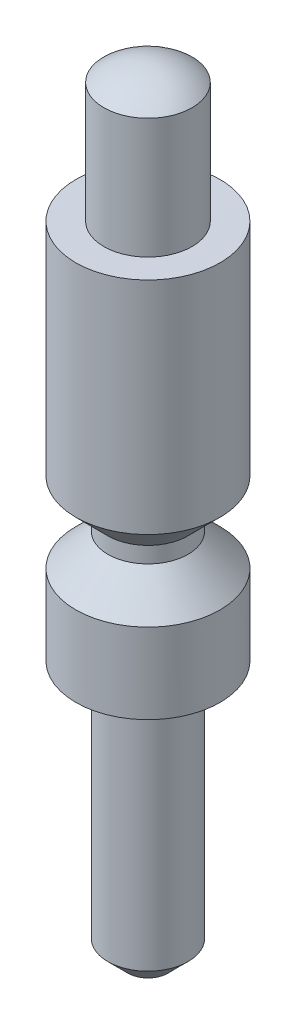
ISO-10303-21;
HEADER;
FILE_DESCRIPTION(('STEP AP214'),'2;1');
FILE_NAME('part.step','',(''),(''),'','','');
FILE_SCHEMA(('AUTOMOTIVE_DESIGN { 1 0 10303 214 1 1 1 1 }'));
ENDSEC;
DATA;
#1=APPLICATION_CONTEXT('core data for automotive mechanical design processes');
#2=APPLICATION_PROTOCOL_DEFINITION('international standard','automotive_design',2000,#1);
#3=PRODUCT_CONTEXT('',#1,'mechanical');
#4=PRODUCT('Part','Part','',(#3));
#5=PRODUCT_RELATED_PRODUCT_CATEGORY('part','',(#4));
#6=PRODUCT_DEFINITION_FORMATION('','',#4);
#7=PRODUCT_DEFINITION_CONTEXT('part definition',#1,'design');
#8=PRODUCT_DEFINITION('design','',#6,#7);
#9=PRODUCT_DEFINITION_SHAPE('','',#8);
#10=(LENGTH_UNIT() NAMED_UNIT(*) SI_UNIT(.MILLI.,.METRE.));
#11=(NAMED_UNIT(*) PLANE_ANGLE_UNIT() SI_UNIT($,.RADIAN.));
#12=(NAMED_UNIT(*) SI_UNIT($,.STERADIAN.) SOLID_ANGLE_UNIT());
#13=UNCERTAINTY_MEASURE_WITH_UNIT(LENGTH_MEASURE(1.E-05),#10,'distance_accuracy_value','');
#14=(GEOMETRIC_REPRESENTATION_CONTEXT(3) GLOBAL_UNCERTAINTY_ASSIGNED_CONTEXT((#13)) GLOBAL_UNIT_ASSIGNED_CONTEXT((#10,
#11,#12)) REPRESENTATION_CONTEXT('',''));
#15=CARTESIAN_POINT('',(0.,0.,0.));
#16=DIRECTION('',(0.,0.,1.));
#17=DIRECTION('',(1.,0.,0.));
#18=AXIS2_PLACEMENT_3D('',#15,#16,#17);
#19=CARTESIAN_POINT('',(-28.92728245926,-5.552019390202,8.065515978186));
#20=DIRECTION('',(0.,-1.,0.));
#21=DIRECTION('',(0.,0.,-1.));
#22=AXIS2_PLACEMENT_3D('',#19,#20,#21);
#23=PLANE('',#22);
#24=CARTESIAN_POINT('',(-29.17728245926,-5.55201939027938,8.065515978186));
#25=DIRECTION('',(0.,1.,0.));
#26=DIRECTION('',(0.,0.,1.));
#27=AXIS2_PLACEMENT_3D('',#24,#25,#26);
#28=CIRCLE('',#27,0.250000000024897);
#29=CARTESIAN_POINT('',(-29.17728245926,-5.55201939027938,8.3155159782109));
#30=VERTEX_POINT('',#29);
#31=EDGE_CURVE('E18',#30,#30,#28,.T.);
#32=ORIENTED_EDGE('',*,*,#31,.F.);
#33=EDGE_LOOP('',(#32));
#34=FACE_BOUND('',#33,.T.);
#35=ADVANCED_FACE('F15',(#34),#23,.T.);
#36=CARTESIAN_POINT('',(-29.17728245926,-5.3020193902853,8.065515978186));
#37=DIRECTION('',(0.,1.,0.));
#38=DIRECTION('',(0.,0.,1.));
#39=AXIS2_PLACEMENT_3D('',#36,#37,#38);
#40=CONICAL_SURFACE('',#39,0.500000000018985,0.785398163397448);
#41=ORIENTED_EDGE('',*,*,#31,.T.);
#42=EDGE_LOOP('',(#41));
#43=FACE_BOUND('',#42,.T.);
#44=CARTESIAN_POINT('',(-29.17728245926,-5.302019390202,8.065515978186));
#45=DIRECTION('',(0.,1.,0.));
#46=DIRECTION('',(0.,0.,1.));
#47=AXIS2_PLACEMENT_3D('',#44,#45,#46);
#48=CIRCLE('',#47,0.5);
#49=CARTESIAN_POINT('',(-29.17728245926,-5.302019390202,8.565515978186));
#50=VERTEX_POINT('',#49);
#51=EDGE_CURVE('E35',#50,#50,#48,.T.);
#52=ORIENTED_EDGE('',*,*,#51,.F.);
#53=EDGE_LOOP('',(#52));
#54=FACE_BOUND('',#53,.T.);
#55=ADVANCED_FACE('F55',(#43,#54),#40,.T.);
#56=CARTESIAN_POINT('',(-29.17728245926,2.447980609798,8.065515978186));
#57=DIRECTION('',(0.,1.,0.));
#58=DIRECTION('',(0.,0.,1.));
#59=AXIS2_PLACEMENT_3D('',#56,#57,#58);
#60=CYLINDRICAL_SURFACE('',#59,0.5);
#61=CARTESIAN_POINT('',(-29.17728245926,-2.302019390202,8.065515978186));
#62=DIRECTION('',(0.,1.,0.));
#63=DIRECTION('',(0.,0.,1.));
#64=AXIS2_PLACEMENT_3D('',#61,#62,#63);
#65=CIRCLE('',#64,0.5);
#66=CARTESIAN_POINT('',(-29.17728245926,-2.302019390202,8.565515978186));
#67=VERTEX_POINT('',#66);
#68=EDGE_CURVE('E106',#67,#67,#65,.T.);
#69=ORIENTED_EDGE('',*,*,#68,.F.);
#70=EDGE_LOOP('',(#69));
#71=FACE_BOUND('',#70,.T.);
#72=ORIENTED_EDGE('',*,*,#51,.T.);
#73=EDGE_LOOP('',(#72));
#74=FACE_BOUND('',#73,.T.);
#75=ADVANCED_FACE('F52',(#71,#74),#60,.T.);
#76=CARTESIAN_POINT('',(-28.27728245926,-2.302019390202,8.065515978186));
#77=DIRECTION('',(0.,-1.,0.));
#78=DIRECTION('',(0.,0.,-1.));
#79=AXIS2_PLACEMENT_3D('',#76,#77,#78);
#80=PLANE('',#79);
#81=ORIENTED_EDGE('',*,*,#68,.T.);
#82=EDGE_LOOP('',(#81));
#83=FACE_BOUND('',#82,.T.);
#84=CARTESIAN_POINT('',(-29.17728245926,-2.302019390202,8.065515978186));
#85=DIRECTION('',(0.,1.,0.));
#86=DIRECTION('',(0.,0.,1.));
#87=AXIS2_PLACEMENT_3D('',#84,#85,#86);
#88=CIRCLE('',#87,0.9);
#89=CARTESIAN_POINT('',(-29.17728245926,-2.302019390202,8.965515978186));
#90=VERTEX_POINT('',#89);
#91=EDGE_CURVE('E104',#90,#90,#88,.T.);
#92=ORIENTED_EDGE('',*,*,#91,.F.);
#93=EDGE_LOOP('',(#92));
#94=FACE_BOUND('',#93,.T.);
#95=ADVANCED_FACE('F48',(#83,#94),#80,.T.);
#96=CARTESIAN_POINT('',(-29.17728245926,2.447980609798,8.065515978186));
#97=DIRECTION('',(0.,1.,0.));
#98=DIRECTION('',(0.,0.,1.));
#99=AXIS2_PLACEMENT_3D('',#96,#97,#98);
#100=CYLINDRICAL_SURFACE('',#99,0.9);
#101=CARTESIAN_POINT('',(-29.17728245926,-1.30201939020935,8.065515978186));
#102=DIRECTION('',(0.,-1.,0.));
#103=DIRECTION('',(0.,0.,-1.));
#104=AXIS2_PLACEMENT_3D('',#101,#102,#103);
#105=CIRCLE('',#104,0.900000000084333);
#106=CARTESIAN_POINT('',(-29.17728245926,-1.30201939020935,7.16551597810167));
#107=VERTEX_POINT('',#106);
#108=EDGE_CURVE('E103',#107,#107,#105,.F.);
#109=ORIENTED_EDGE('',*,*,#108,.F.);
#110=EDGE_LOOP('',(#109));
#111=FACE_BOUND('',#110,.T.);
#112=ORIENTED_EDGE('',*,*,#91,.T.);
#113=EDGE_LOOP('',(#112));
#114=FACE_BOUND('',#113,.T.);
#115=ADVANCED_FACE('F43',(#111,#114),#100,.T.);
#116=CARTESIAN_POINT('',(-29.17728245926,3.291730609798,8.065515978186));
#117=DIRECTION('',(1.,0.,0.));
#118=DIRECTION('',(0.,1.,0.));
#119=AXIS2_PLACEMENT_3D('',#116,#117,#118);
#120=SPHERICAL_SURFACE('',#119,0.85625);
#121=CARTESIAN_POINT('',(-29.17728245926,3.947980609798,8.065515978186));
#122=DIRECTION('',(0.,1.,0.));
#123=DIRECTION('',(0.,0.,1.));
#124=AXIS2_PLACEMENT_3D('',#121,#122,#123);
#125=CIRCLE('',#124,0.55);
#126=CARTESIAN_POINT('',(-29.17728245926,3.947980609798,8.615515978186));
#127=VERTEX_POINT('',#126);
#128=EDGE_CURVE('E94',#127,#127,#125,.F.);
#129=ORIENTED_EDGE('',*,*,#128,.F.);
#130=EDGE_LOOP('',(#129));
#131=FACE_BOUND('',#130,.T.);
#132=ADVANCED_FACE('F38',(#131),#120,.T.);
#133=CARTESIAN_POINT('',(-29.17728245926,-1.30201939015251,8.065515978186));
#134=DIRECTION('',(0.,-1.,0.));
#135=DIRECTION('',(0.,0.,-1.));
#136=AXIS2_PLACEMENT_3D('',#133,#134,#135);
#137=CONICAL_SURFACE('',#136,0.899999999970647,0.785398163397448);
#138=CARTESIAN_POINT('',(-29.17728245926,-0.902019390202,8.065515978186));
#139=DIRECTION('',(0.,1.,0.));
#140=DIRECTION('',(0.,0.,1.));
#141=AXIS2_PLACEMENT_3D('',#138,#139,#140);
#142=CIRCLE('',#141,0.5);
#143=CARTESIAN_POINT('',(-29.17728245926,-0.902019390202,8.565515978186));
#144=VERTEX_POINT('',#143);
#145=EDGE_CURVE('E97',#144,#144,#142,.T.);
#146=ORIENTED_EDGE('',*,*,#145,.F.);
#147=EDGE_LOOP('',(#146));
#148=FACE_BOUND('',#147,.T.);
#149=ORIENTED_EDGE('',*,*,#108,.T.);
#150=EDGE_LOOP('',(#149));
#151=FACE_BOUND('',#150,.T.);
#152=ADVANCED_FACE('F42',(#148,#151),#137,.T.);
#153=CARTESIAN_POINT('',(-29.17728245926,2.447980609798,8.065515978186));
#154=DIRECTION('',(0.,1.,0.));
#155=DIRECTION('',(0.,0.,1.));
#156=AXIS2_PLACEMENT_3D('',#153,#154,#155);
#157=CYLINDRICAL_SURFACE('',#156,0.55);
#158=ORIENTED_EDGE('',*,*,#128,.T.);
#159=EDGE_LOOP('',(#158));
#160=FACE_BOUND('',#159,.T.);
#161=CARTESIAN_POINT('',(-29.17728245926,2.447980609798,8.065515978186));
#162=DIRECTION('',(0.,1.,0.));
#163=DIRECTION('',(0.,0.,1.));
#164=AXIS2_PLACEMENT_3D('',#161,#162,#163);
#165=CIRCLE('',#164,0.55);
#166=CARTESIAN_POINT('',(-29.17728245926,2.447980609798,8.615515978186));
#167=VERTEX_POINT('',#166);
#168=EDGE_CURVE('E32',#167,#167,#165,.F.);
#169=ORIENTED_EDGE('',*,*,#168,.F.);
#170=EDGE_LOOP('',(#169));
#171=FACE_BOUND('',#170,.T.);
#172=ADVANCED_FACE('F83',(#160,#171),#157,.T.);
#173=CARTESIAN_POINT('',(-29.17728245926,2.447980609798,8.065515978186));
#174=DIRECTION('',(0.,1.,0.));
#175=DIRECTION('',(0.,0.,1.));
#176=AXIS2_PLACEMENT_3D('',#173,#174,#175);
#177=CYLINDRICAL_SURFACE('',#176,0.5);
#178=ORIENTED_EDGE('',*,*,#145,.T.);
#179=EDGE_LOOP('',(#178));
#180=FACE_BOUND('',#179,.T.);
#181=CARTESIAN_POINT('',(-29.17728245926,-0.702019390246278,8.065515978186));
#182=DIRECTION('',(0.,1.,0.));
#183=DIRECTION('',(0.,0.,1.));
#184=AXIS2_PLACEMENT_3D('',#181,#182,#183);
#185=CIRCLE('',#184,0.500000000018985);
#186=CARTESIAN_POINT('',(-29.17728245926,-0.702019390246278,8.56551597820499));
#187=VERTEX_POINT('',#186);
#188=EDGE_CURVE('E27',#187,#187,#185,.T.);
#189=ORIENTED_EDGE('',*,*,#188,.F.);
#190=EDGE_LOOP('',(#189));
#191=FACE_BOUND('',#190,.T.);
#192=ADVANCED_FACE('F80',(#180,#191),#177,.T.);
#193=CARTESIAN_POINT('',(-28.62728245926,2.447980609798,8.065515978186));
#194=DIRECTION('',(0.,1.,0.));
#195=DIRECTION('',(0.,0.,1.));
#196=AXIS2_PLACEMENT_3D('',#193,#194,#195);
#197=PLANE('',#196);
#198=ORIENTED_EDGE('',*,*,#168,.T.);
#199=EDGE_LOOP('',(#198));
#200=FACE_BOUND('',#199,.T.);
#201=CARTESIAN_POINT('',(-29.17728245926,2.447980609798,8.065515978186));
#202=DIRECTION('',(0.,1.,0.));
#203=DIRECTION('',(0.,0.,1.));
#204=AXIS2_PLACEMENT_3D('',#201,#202,#203);
#205=CIRCLE('',#204,0.9);
#206=CARTESIAN_POINT('',(-29.17728245926,2.447980609798,8.965515978186));
#207=VERTEX_POINT('',#206);
#208=EDGE_CURVE('E22',#207,#207,#205,.F.);
#209=ORIENTED_EDGE('',*,*,#208,.F.);
#210=EDGE_LOOP('',(#209));
#211=FACE_BOUND('',#210,.T.);
#212=ADVANCED_FACE('F73',(#200,#211),#197,.T.);
#213=CARTESIAN_POINT('',(-29.17728245926,-0.302019390232999,8.065515978186));
#214=DIRECTION('',(0.,1.,0.));
#215=DIRECTION('',(0.,0.,1.));
#216=AXIS2_PLACEMENT_3D('',#213,#214,#215);
#217=CONICAL_SURFACE('',#216,0.89999999997542,0.785398163326394);
#218=CARTESIAN_POINT('',(-29.17728245926,-0.302019390202,8.065515978186));
#219=DIRECTION('',(0.,1.,0.));
#220=DIRECTION('',(0.,0.,1.));
#221=AXIS2_PLACEMENT_3D('',#218,#219,#220);
#222=CIRCLE('',#221,0.9);
#223=CARTESIAN_POINT('',(-29.17728245926,-0.302019390202,8.965515978186));
#224=VERTEX_POINT('',#223);
#225=EDGE_CURVE('E10',#224,#224,#222,.T.);
#226=ORIENTED_EDGE('',*,*,#225,.F.);
#227=EDGE_LOOP('',(#226));
#228=FACE_BOUND('',#227,.T.);
#229=ORIENTED_EDGE('',*,*,#188,.T.);
#230=EDGE_LOOP('',(#229));
#231=FACE_BOUND('',#230,.T.);
#232=ADVANCED_FACE('F68',(#228,#231),#217,.T.);
#233=CARTESIAN_POINT('',(-29.17728245926,2.447980609798,8.065515978186));
#234=DIRECTION('',(0.,1.,0.));
#235=DIRECTION('',(0.,0.,1.));
#236=AXIS2_PLACEMENT_3D('',#233,#234,#235);
#237=CYLINDRICAL_SURFACE('',#236,0.9);
#238=ORIENTED_EDGE('',*,*,#225,.T.);
#239=EDGE_LOOP('',(#238));
#240=FACE_BOUND('',#239,.T.);
#241=ORIENTED_EDGE('',*,*,#208,.T.);
#242=EDGE_LOOP('',(#241));
#243=FACE_BOUND('',#242,.T.);
#244=ADVANCED_FACE('F66',(#240,#243),#237,.T.);
#245=CLOSED_SHELL('',(#35,#55,#75,#95,#115,#132,#152,#172,#192,#212,#232,#244));
#246=MANIFOLD_SOLID_BREP('B1',#245);
#247=ADVANCED_BREP_SHAPE_REPRESENTATION('',(#18,#246),#14);
#248=SHAPE_DEFINITION_REPRESENTATION(#9,#247);
ENDSEC;
END-ISO-10303-21;
